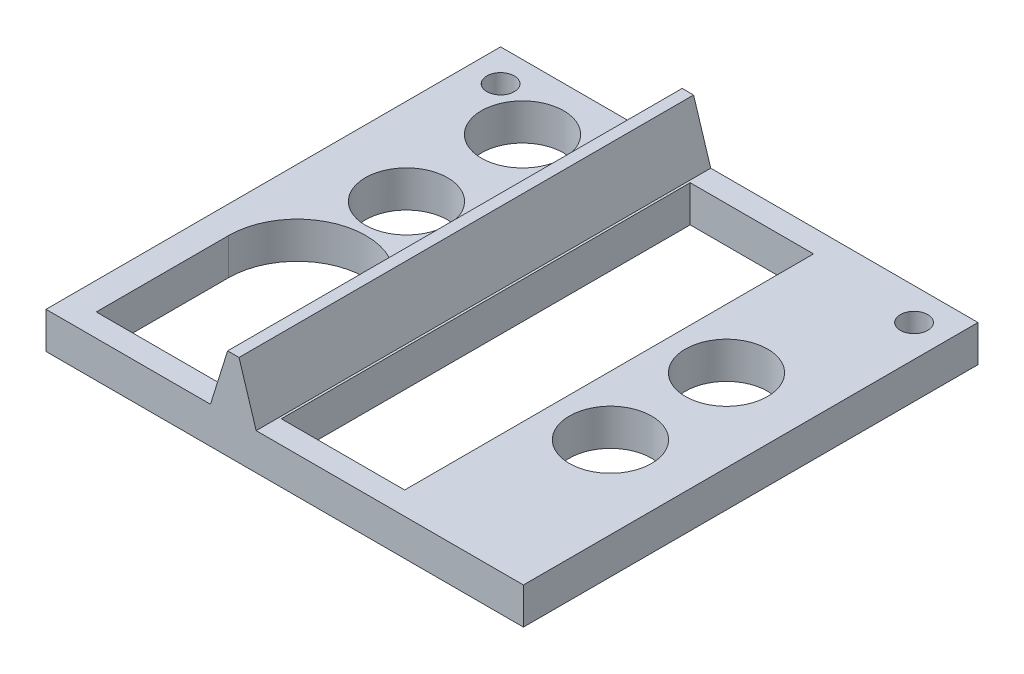
ISO-10303-21;
HEADER;
FILE_DESCRIPTION(('STEP AP214'),'2;1');
FILE_NAME('part.step','',(''),(''),'','','');
FILE_SCHEMA(('AUTOMOTIVE_DESIGN { 1 0 10303 214 1 1 1 1 }'));
ENDSEC;
DATA;
#1=APPLICATION_CONTEXT('core data for automotive mechanical design processes');
#2=APPLICATION_PROTOCOL_DEFINITION('international standard','automotive_design',2000,#1);
#3=PRODUCT_CONTEXT('',#1,'mechanical');
#4=PRODUCT('Part','Part','',(#3));
#5=PRODUCT_RELATED_PRODUCT_CATEGORY('part','',(#4));
#6=PRODUCT_DEFINITION_FORMATION('','',#4);
#7=PRODUCT_DEFINITION_CONTEXT('part definition',#1,'design');
#8=PRODUCT_DEFINITION('design','',#6,#7);
#9=PRODUCT_DEFINITION_SHAPE('','',#8);
#10=(LENGTH_UNIT() NAMED_UNIT(*) SI_UNIT(.MILLI.,.METRE.));
#11=(NAMED_UNIT(*) PLANE_ANGLE_UNIT() SI_UNIT($,.RADIAN.));
#12=(NAMED_UNIT(*) SI_UNIT($,.STERADIAN.) SOLID_ANGLE_UNIT());
#13=UNCERTAINTY_MEASURE_WITH_UNIT(LENGTH_MEASURE(1.E-05),#10,'distance_accuracy_value','');
#14=(GEOMETRIC_REPRESENTATION_CONTEXT(3) GLOBAL_UNCERTAINTY_ASSIGNED_CONTEXT((#13)) GLOBAL_UNIT_ASSIGNED_CONTEXT((#10,
#11,#12)) REPRESENTATION_CONTEXT('',''));
#15=CARTESIAN_POINT('',(0.,0.,0.));
#16=DIRECTION('',(0.,0.,1.));
#17=DIRECTION('',(1.,0.,0.));
#18=AXIS2_PLACEMENT_3D('',#15,#16,#17);
#19=CARTESIAN_POINT('',(-31.25,8.001,15.76));
#20=DIRECTION('',(0.,-1.,0.));
#21=DIRECTION('',(0.,0.,-1.));
#22=AXIS2_PLACEMENT_3D('',#19,#20,#21);
#23=CYLINDRICAL_SURFACE('',#22,15.);
#24=DIRECTION('',(0.,-1.,0.));
#25=VECTOR('',#24,1.);
#26=CARTESIAN_POINT('',(-46.25,8.001,15.76));
#27=LINE('',#26,#25);
#28=CARTESIAN_POINT('',(-46.25,0.,15.76));
#29=VERTEX_POINT('',#28);
#30=CARTESIAN_POINT('',(-46.25,8.,15.76));
#31=VERTEX_POINT('',#30);
#32=EDGE_CURVE('E176',#29,#31,#27,.F.);
#33=ORIENTED_EDGE('',*,*,#32,.F.);
#34=CARTESIAN_POINT('',(-31.25,0.,15.76));
#35=DIRECTION('',(0.,-1.,0.));
#36=DIRECTION('',(0.,0.,-1.));
#37=AXIS2_PLACEMENT_3D('',#34,#35,#36);
#38=CIRCLE('',#37,15.);
#39=CARTESIAN_POINT('',(-16.25,0.,15.76));
#40=VERTEX_POINT('',#39);
#41=EDGE_CURVE('E174',#29,#40,#38,.T.);
#42=ORIENTED_EDGE('',*,*,#41,.T.);
#43=DIRECTION('',(0.,-1.,0.));
#44=VECTOR('',#43,1.);
#45=CARTESIAN_POINT('',(-16.25,8.001,15.76));
#46=LINE('',#45,#44);
#47=CARTESIAN_POINT('',(-16.25,8.,15.76));
#48=VERTEX_POINT('',#47);
#49=EDGE_CURVE('E157',#48,#40,#46,.T.);
#50=ORIENTED_EDGE('',*,*,#49,.F.);
#51=CARTESIAN_POINT('',(-31.25,8.,15.76));
#52=DIRECTION('',(0.,1.,0.));
#53=DIRECTION('',(0.,0.,1.));
#54=AXIS2_PLACEMENT_3D('',#51,#52,#53);
#55=CIRCLE('',#54,15.);
#56=EDGE_CURVE('E172',#31,#48,#55,.F.);
#57=ORIENTED_EDGE('',*,*,#56,.F.);
#58=EDGE_LOOP('',(#33,#42,#50,#57));
#59=FACE_BOUND('',#58,.T.);
#60=ADVANCED_FACE('F39',(#59),#23,.F.);
#61=CARTESIAN_POINT('',(0.,8.,0.));
#62=DIRECTION('',(0.,1.,0.));
#63=DIRECTION('',(0.,0.,1.));
#64=AXIS2_PLACEMENT_3D('',#61,#62,#63);
#65=PLANE('',#64);
#66=CARTESIAN_POINT('',(-45.25,8.,-42.75));
#67=DIRECTION('',(0.,1.,0.));
#68=DIRECTION('',(0.,0.,1.));
#69=AXIS2_PLACEMENT_3D('',#66,#67,#68);
#70=CIRCLE('',#69,3.);
#71=CARTESIAN_POINT('',(-45.25,8.,-39.75));
#72=VERTEX_POINT('',#71);
#73=EDGE_CURVE('E396',#72,#72,#70,.T.);
#74=ORIENTED_EDGE('',*,*,#73,.F.);
#75=EDGE_LOOP('',(#74));
#76=FACE_BOUND('',#75,.T.);
#77=DIRECTION('',(0.,0.,1.));
#78=VECTOR('',#77,1.);
#79=CARTESIAN_POINT('',(-46.25,8.,15.76));
#80=LINE('',#79,#78);
#81=CARTESIAN_POINT('',(-46.25,8.,44.75));
#82=VERTEX_POINT('',#81);
#83=EDGE_CURVE('E185',#31,#82,#80,.T.);
#84=ORIENTED_EDGE('',*,*,#83,.F.);
#85=ORIENTED_EDGE('',*,*,#56,.T.);
#86=DIRECTION('',(0.,0.,-1.));
#87=VECTOR('',#86,1.);
#88=CARTESIAN_POINT('',(-16.25,8.,65.3704993518133));
#89=LINE('',#88,#87);
#90=CARTESIAN_POINT('',(-16.25,8.,-49.75));
#91=VERTEX_POINT('',#90);
#92=EDGE_CURVE('E11',#48,#91,#89,.T.);
#93=ORIENTED_EDGE('',*,*,#92,.T.);
#94=DIRECTION('',(-1.,0.,0.));
#95=VECTOR('',#94,1.);
#96=CARTESIAN_POINT('',(-52.25,8.,-49.75));
#97=LINE('',#96,#95);
#98=CARTESIAN_POINT('',(-52.25,8.,-49.75));
#99=VERTEX_POINT('',#98);
#100=EDGE_CURVE('E278',#91,#99,#97,.T.);
#101=ORIENTED_EDGE('',*,*,#100,.T.);
#102=DIRECTION('',(0.,0.,1.));
#103=VECTOR('',#102,1.);
#104=CARTESIAN_POINT('',(-52.25,8.,-49.75));
#105=LINE('',#104,#103);
#106=CARTESIAN_POINT('',(-52.25,8.,49.75));
#107=VERTEX_POINT('',#106);
#108=EDGE_CURVE('E266',#99,#107,#105,.T.);
#109=ORIENTED_EDGE('',*,*,#108,.T.);
#110=DIRECTION('',(1.,0.,0.));
#111=VECTOR('',#110,1.);
#112=CARTESIAN_POINT('',(-52.25,8.,49.75));
#113=LINE('',#112,#111);
#114=CARTESIAN_POINT('',(-16.25,8.,49.75));
#115=VERTEX_POINT('',#114);
#116=EDGE_CURVE('E272',#107,#115,#113,.T.);
#117=ORIENTED_EDGE('',*,*,#116,.T.);
#118=CARTESIAN_POINT('',(-16.25,8.,44.75));
#119=VERTEX_POINT('',#118);
#120=EDGE_CURVE('E50',#115,#119,#89,.T.);
#121=ORIENTED_EDGE('',*,*,#120,.T.);
#122=DIRECTION('',(1.,0.,0.));
#123=VECTOR('',#122,1.);
#124=CARTESIAN_POINT('',(-46.25,8.,44.75));
#125=LINE('',#124,#123);
#126=EDGE_CURVE('E57',#82,#119,#125,.T.);
#127=ORIENTED_EDGE('',*,*,#126,.F.);
#128=EDGE_LOOP('',(#84,#85,#93,#101,#109,#117,#121,#127));
#129=FACE_BOUND('',#128,.T.);
#130=CARTESIAN_POINT('',(-33.25,8.,-10.15));
#131=DIRECTION('',(0.,1.,0.));
#132=DIRECTION('',(0.,0.,1.));
#133=AXIS2_PLACEMENT_3D('',#130,#131,#132);
#134=CIRCLE('',#133,9.00000000000001);
#135=CARTESIAN_POINT('',(-33.25,8.,-1.15000000000001));
#136=VERTEX_POINT('',#135);
#137=EDGE_CURVE('E246',#136,#136,#134,.F.);
#138=ORIENTED_EDGE('',*,*,#137,.T.);
#139=EDGE_LOOP('',(#138));
#140=FACE_BOUND('',#139,.T.);
#141=CARTESIAN_POINT('',(-33.25,8.,-35.55));
#142=DIRECTION('',(0.,1.,0.));
#143=DIRECTION('',(0.,0.,1.));
#144=AXIS2_PLACEMENT_3D('',#141,#142,#143);
#145=CIRCLE('',#144,9.00000000000001);
#146=CARTESIAN_POINT('',(-33.25,8.,-26.55));
#147=VERTEX_POINT('',#146);
#148=EDGE_CURVE('E247',#147,#147,#145,.F.);
#149=ORIENTED_EDGE('',*,*,#148,.T.);
#150=EDGE_LOOP('',(#149));
#151=FACE_BOUND('',#150,.T.);
#152=ADVANCED_FACE('F181',(#76,#129,#140,#151),#65,.T.);
#153=CARTESIAN_POINT('',(-52.25,8.,-49.75));
#154=DIRECTION('',(1.,0.,0.));
#155=DIRECTION('',(0.,0.,-1.));
#156=AXIS2_PLACEMENT_3D('',#153,#154,#155);
#157=PLANE('',#156);
#158=DIRECTION('',(0.,0.,1.));
#159=VECTOR('',#158,1.);
#160=CARTESIAN_POINT('',(-52.25,0.,-49.75));
#161=LINE('',#160,#159);
#162=CARTESIAN_POINT('',(-52.25,0.,-49.75));
#163=VERTEX_POINT('',#162);
#164=CARTESIAN_POINT('',(-52.25,0.,49.75));
#165=VERTEX_POINT('',#164);
#166=EDGE_CURVE('E262',#163,#165,#161,.T.);
#167=ORIENTED_EDGE('',*,*,#166,.T.);
#168=DIRECTION('',(0.,-1.,0.));
#169=VECTOR('',#168,1.);
#170=CARTESIAN_POINT('',(-52.25,8.,49.75));
#171=LINE('',#170,#169);
#172=EDGE_CURVE('E43',#107,#165,#171,.T.);
#173=ORIENTED_EDGE('',*,*,#172,.F.);
#174=ORIENTED_EDGE('',*,*,#108,.F.);
#175=DIRECTION('',(0.,-1.,0.));
#176=VECTOR('',#175,1.);
#177=CARTESIAN_POINT('',(-52.25,8.,-49.75));
#178=LINE('',#177,#176);
#179=EDGE_CURVE('E282',#99,#163,#178,.T.);
#180=ORIENTED_EDGE('',*,*,#179,.T.);
#181=EDGE_LOOP('',(#167,#173,#174,#180));
#182=FACE_BOUND('',#181,.T.);
#183=ADVANCED_FACE('F41',(#182),#157,.F.);
#184=CARTESIAN_POINT('',(-52.25,8.,49.75));
#185=DIRECTION('',(0.,0.,-1.));
#186=DIRECTION('',(-1.,0.,0.));
#187=AXIS2_PLACEMENT_3D('',#184,#185,#186);
#188=PLANE('',#187);
#189=DIRECTION('',(1.,0.,0.));
#190=VECTOR('',#189,1.);
#191=CARTESIAN_POINT('',(-52.25,0.,49.75));
#192=LINE('',#191,#190);
#193=CARTESIAN_POINT('',(52.25,0.,49.75));
#194=VERTEX_POINT('',#193);
#195=EDGE_CURVE('E286',#165,#194,#192,.T.);
#196=ORIENTED_EDGE('',*,*,#195,.T.);
#197=DIRECTION('',(0.,-1.,0.));
#198=VECTOR('',#197,1.);
#199=CARTESIAN_POINT('',(52.25,8.,49.75));
#200=LINE('',#199,#198);
#201=CARTESIAN_POINT('',(52.25,8.,49.75));
#202=VERTEX_POINT('',#201);
#203=EDGE_CURVE('E300',#202,#194,#200,.T.);
#204=ORIENTED_EDGE('',*,*,#203,.F.);
#205=CARTESIAN_POINT('',(-6.25000000000001,8.,49.75));
#206=VERTEX_POINT('',#205);
#207=EDGE_CURVE('E270',#206,#202,#113,.T.);
#208=ORIENTED_EDGE('',*,*,#207,.F.);
#209=DIRECTION('',(-0.298274993135947,0.95447997803503,0.));
#210=VECTOR('',#209,1.);
#211=CARTESIAN_POINT('',(-6.24999999999998,8.,49.75));
#212=LINE('',#211,#210);
#213=CARTESIAN_POINT('',(-9.99999999999998,20.,49.75));
#214=VERTEX_POINT('',#213);
#215=EDGE_CURVE('E211',#206,#214,#212,.T.);
#216=ORIENTED_EDGE('',*,*,#215,.T.);
#217=DIRECTION('',(-1.,0.,0.));
#218=VECTOR('',#217,1.);
#219=CARTESIAN_POINT('',(-9.99999999999998,20.,49.75));
#220=LINE('',#219,#218);
#221=CARTESIAN_POINT('',(-12.5,20.,49.75));
#222=VERTEX_POINT('',#221);
#223=EDGE_CURVE('E221',#214,#222,#220,.T.);
#224=ORIENTED_EDGE('',*,*,#223,.T.);
#225=DIRECTION('',(-0.298274993135947,-0.95447997803503,0.));
#226=VECTOR('',#225,1.);
#227=CARTESIAN_POINT('',(-12.5,20.,49.75));
#228=LINE('',#227,#226);
#229=EDGE_CURVE('E187',#222,#115,#228,.T.);
#230=ORIENTED_EDGE('',*,*,#229,.T.);
#231=ORIENTED_EDGE('',*,*,#116,.F.);
#232=ORIENTED_EDGE('',*,*,#172,.T.);
#233=EDGE_LOOP('',(#196,#204,#208,#216,#224,#230,#231,#232));
#234=FACE_BOUND('',#233,.T.);
#235=ADVANCED_FACE('F311',(#234),#188,.F.);
#236=CARTESIAN_POINT('',(52.25,8.,-49.75));
#237=DIRECTION('',(-1.,0.,0.));
#238=DIRECTION('',(0.,0.,1.));
#239=AXIS2_PLACEMENT_3D('',#236,#237,#238);
#240=PLANE('',#239);
#241=DIRECTION('',(0.,0.,-1.));
#242=VECTOR('',#241,1.);
#243=CARTESIAN_POINT('',(52.25,0.,-49.75));
#244=LINE('',#243,#242);
#245=CARTESIAN_POINT('',(52.25,0.,-49.75));
#246=VERTEX_POINT('',#245);
#247=EDGE_CURVE('E289',#194,#246,#244,.T.);
#248=ORIENTED_EDGE('',*,*,#247,.T.);
#249=DIRECTION('',(0.,-1.,0.));
#250=VECTOR('',#249,1.);
#251=CARTESIAN_POINT('',(52.25,8.,-49.75));
#252=LINE('',#251,#250);
#253=CARTESIAN_POINT('',(52.25,8.,-49.75));
#254=VERTEX_POINT('',#253);
#255=EDGE_CURVE('E297',#254,#246,#252,.T.);
#256=ORIENTED_EDGE('',*,*,#255,.F.);
#257=DIRECTION('',(0.,0.,-1.));
#258=VECTOR('',#257,1.);
#259=CARTESIAN_POINT('',(52.25,8.,-49.75));
#260=LINE('',#259,#258);
#261=EDGE_CURVE('E275',#202,#254,#260,.T.);
#262=ORIENTED_EDGE('',*,*,#261,.F.);
#263=ORIENTED_EDGE('',*,*,#203,.T.);
#264=EDGE_LOOP('',(#248,#256,#262,#263));
#265=FACE_BOUND('',#264,.T.);
#266=ADVANCED_FACE('F320',(#265),#240,.F.);
#267=CARTESIAN_POINT('',(-52.25,8.,-49.75));
#268=DIRECTION('',(0.,0.,1.));
#269=DIRECTION('',(1.,0.,0.));
#270=AXIS2_PLACEMENT_3D('',#267,#268,#269);
#271=PLANE('',#270);
#272=DIRECTION('',(-1.,0.,0.));
#273=VECTOR('',#272,1.);
#274=CARTESIAN_POINT('',(-52.25,0.,-49.75));
#275=LINE('',#274,#273);
#276=EDGE_CURVE('E271',#246,#163,#275,.T.);
#277=ORIENTED_EDGE('',*,*,#276,.T.);
#278=ORIENTED_EDGE('',*,*,#179,.F.);
#279=ORIENTED_EDGE('',*,*,#100,.F.);
#280=DIRECTION('',(0.298274993135947,0.95447997803503,0.));
#281=VECTOR('',#280,1.);
#282=CARTESIAN_POINT('',(-12.5,20.,-49.75));
#283=LINE('',#282,#281);
#284=CARTESIAN_POINT('',(-12.5,20.,-49.75));
#285=VERTEX_POINT('',#284);
#286=EDGE_CURVE('E193',#91,#285,#283,.T.);
#287=ORIENTED_EDGE('',*,*,#286,.T.);
#288=DIRECTION('',(1.,0.,0.));
#289=VECTOR('',#288,1.);
#290=CARTESIAN_POINT('',(-9.99999999999999,20.,-49.75));
#291=LINE('',#290,#289);
#292=CARTESIAN_POINT('',(-9.99999999999999,20.,-49.75));
#293=VERTEX_POINT('',#292);
#294=EDGE_CURVE('E200',#285,#293,#291,.T.);
#295=ORIENTED_EDGE('',*,*,#294,.T.);
#296=DIRECTION('',(0.298274993135947,-0.95447997803503,0.));
#297=VECTOR('',#296,1.);
#298=CARTESIAN_POINT('',(-6.25,8.,-49.75));
#299=LINE('',#298,#297);
#300=CARTESIAN_POINT('',(-6.25,8.,-49.75));
#301=VERTEX_POINT('',#300);
#302=EDGE_CURVE('E205',#293,#301,#299,.T.);
#303=ORIENTED_EDGE('',*,*,#302,.T.);
#304=EDGE_CURVE('E279',#254,#301,#97,.T.);
#305=ORIENTED_EDGE('',*,*,#304,.F.);
#306=ORIENTED_EDGE('',*,*,#255,.T.);
#307=EDGE_LOOP('',(#277,#278,#279,#287,#295,#303,#305,#306));
#308=FACE_BOUND('',#307,.T.);
#309=ADVANCED_FACE('F322',(#308),#271,.F.);
#310=CARTESIAN_POINT('',(45.25,8.,-42.75));
#311=DIRECTION('',(0.,1.,0.));
#312=DIRECTION('',(0.,0.,1.));
#313=AXIS2_PLACEMENT_3D('',#310,#311,#312);
#314=CIRCLE('',#313,3.);
#315=CARTESIAN_POINT('',(45.25,8.,-39.75));
#316=VERTEX_POINT('',#315);
#317=EDGE_CURVE('E397',#316,#316,#314,.T.);
#318=ORIENTED_EDGE('',*,*,#317,.F.);
#319=EDGE_LOOP('',(#318));
#320=FACE_BOUND('',#319,.T.);
#321=DIRECTION('',(0.,0.,1.));
#322=VECTOR('',#321,1.);
#323=CARTESIAN_POINT('',(-5.75000000000001,8.,-44.75));
#324=LINE('',#323,#322);
#325=CARTESIAN_POINT('',(-5.75000000000001,8.,-44.75));
#326=VERTEX_POINT('',#325);
#327=CARTESIAN_POINT('',(-5.74999999999999,8.,44.75));
#328=VERTEX_POINT('',#327);
#329=EDGE_CURVE('E65',#326,#328,#324,.T.);
#330=ORIENTED_EDGE('',*,*,#329,.F.);
#331=DIRECTION('',(-1.,0.,0.));
#332=VECTOR('',#331,1.);
#333=CARTESIAN_POINT('',(-5.75000000000001,8.,-44.75));
#334=LINE('',#333,#332);
#335=CARTESIAN_POINT('',(21.25,8.,-44.75));
#336=VERTEX_POINT('',#335);
#337=EDGE_CURVE('E340',#336,#326,#334,.T.);
#338=ORIENTED_EDGE('',*,*,#337,.F.);
#339=DIRECTION('',(0.,0.,-1.));
#340=VECTOR('',#339,1.);
#341=CARTESIAN_POINT('',(21.25,8.,-44.75));
#342=LINE('',#341,#340);
#343=CARTESIAN_POINT('',(21.25,8.,44.75));
#344=VERTEX_POINT('',#343);
#345=EDGE_CURVE('E351',#344,#336,#342,.T.);
#346=ORIENTED_EDGE('',*,*,#345,.F.);
#347=DIRECTION('',(1.,0.,0.));
#348=VECTOR('',#347,1.);
#349=CARTESIAN_POINT('',(-5.74999999999999,8.,44.75));
#350=LINE('',#349,#348);
#351=EDGE_CURVE('E355',#328,#344,#350,.T.);
#352=ORIENTED_EDGE('',*,*,#351,.F.);
#353=EDGE_LOOP('',(#330,#338,#346,#352));
#354=FACE_BOUND('',#353,.T.);
#355=DIRECTION('',(0.,0.,-1.));
#356=VECTOR('',#355,1.);
#357=CARTESIAN_POINT('',(-6.24999999999998,8.,65.3704993518133));
#358=LINE('',#357,#356);
#359=EDGE_CURVE('E217',#206,#301,#358,.T.);
#360=ORIENTED_EDGE('',*,*,#359,.F.);
#361=ORIENTED_EDGE('',*,*,#207,.T.);
#362=ORIENTED_EDGE('',*,*,#261,.T.);
#363=ORIENTED_EDGE('',*,*,#304,.T.);
#364=EDGE_LOOP('',(#360,#361,#362,#363));
#365=FACE_BOUND('',#364,.T.);
#366=CARTESIAN_POINT('',(34.25,8.,12.7));
#367=DIRECTION('',(0.,1.,0.));
#368=DIRECTION('',(0.,0.,1.));
#369=AXIS2_PLACEMENT_3D('',#366,#367,#368);
#370=CIRCLE('',#369,9.);
#371=CARTESIAN_POINT('',(34.25,8.,21.7));
#372=VERTEX_POINT('',#371);
#373=EDGE_CURVE('E235',#372,#372,#370,.F.);
#374=ORIENTED_EDGE('',*,*,#373,.T.);
#375=EDGE_LOOP('',(#374));
#376=FACE_BOUND('',#375,.T.);
#377=CARTESIAN_POINT('',(34.25,8.,-12.7));
#378=DIRECTION('',(0.,1.,0.));
#379=DIRECTION('',(0.,0.,1.));
#380=AXIS2_PLACEMENT_3D('',#377,#378,#379);
#381=CIRCLE('',#380,9.);
#382=CARTESIAN_POINT('',(34.25,8.,-3.7));
#383=VERTEX_POINT('',#382);
#384=EDGE_CURVE('E236',#383,#383,#381,.F.);
#385=ORIENTED_EDGE('',*,*,#384,.T.);
#386=EDGE_LOOP('',(#385));
#387=FACE_BOUND('',#386,.T.);
#388=ADVANCED_FACE('F325',(#320,#354,#365,#376,#387),#65,.T.);
#389=CARTESIAN_POINT('',(0.,0.,0.));
#390=DIRECTION('',(0.,1.,0.));
#391=DIRECTION('',(0.,0.,1.));
#392=AXIS2_PLACEMENT_3D('',#389,#390,#391);
#393=PLANE('',#392);
#394=CARTESIAN_POINT('',(-45.25,0.,-42.75));
#395=DIRECTION('',(0.,1.,0.));
#396=DIRECTION('',(0.,0.,1.));
#397=AXIS2_PLACEMENT_3D('',#394,#395,#396);
#398=CIRCLE('',#397,3.);
#399=CARTESIAN_POINT('',(-45.25,0.,-39.75));
#400=VERTEX_POINT('',#399);
#401=EDGE_CURVE('E177',#400,#400,#398,.F.);
#402=ORIENTED_EDGE('',*,*,#401,.F.);
#403=EDGE_LOOP('',(#402));
#404=FACE_BOUND('',#403,.T.);
#405=CARTESIAN_POINT('',(45.25,0.,-42.75));
#406=DIRECTION('',(0.,1.,0.));
#407=DIRECTION('',(0.,0.,1.));
#408=AXIS2_PLACEMENT_3D('',#405,#406,#407);
#409=CIRCLE('',#408,3.);
#410=CARTESIAN_POINT('',(45.25,0.,-39.75));
#411=VERTEX_POINT('',#410);
#412=EDGE_CURVE('E392',#411,#411,#409,.F.);
#413=ORIENTED_EDGE('',*,*,#412,.F.);
#414=EDGE_LOOP('',(#413));
#415=FACE_BOUND('',#414,.T.);
#416=ORIENTED_EDGE('',*,*,#41,.F.);
#417=DIRECTION('',(0.,0.,-1.));
#418=VECTOR('',#417,1.);
#419=CARTESIAN_POINT('',(-46.25,0.,15.76));
#420=LINE('',#419,#418);
#421=CARTESIAN_POINT('',(-46.25,0.,44.75));
#422=VERTEX_POINT('',#421);
#423=EDGE_CURVE('E384',#422,#29,#420,.T.);
#424=ORIENTED_EDGE('',*,*,#423,.F.);
#425=DIRECTION('',(-1.,0.,0.));
#426=VECTOR('',#425,1.);
#427=CARTESIAN_POINT('',(-46.25,0.,44.75));
#428=LINE('',#427,#426);
#429=CARTESIAN_POINT('',(-16.25,0.,44.75));
#430=VERTEX_POINT('',#429);
#431=EDGE_CURVE('E372',#430,#422,#428,.T.);
#432=ORIENTED_EDGE('',*,*,#431,.F.);
#433=DIRECTION('',(0.,0.,1.));
#434=VECTOR('',#433,1.);
#435=CARTESIAN_POINT('',(-16.25,0.,15.76));
#436=LINE('',#435,#434);
#437=EDGE_CURVE('E387',#40,#430,#436,.T.);
#438=ORIENTED_EDGE('',*,*,#437,.F.);
#439=EDGE_LOOP('',(#416,#424,#432,#438));
#440=FACE_BOUND('',#439,.T.);
#441=DIRECTION('',(1.,0.,0.));
#442=VECTOR('',#441,1.);
#443=CARTESIAN_POINT('',(-5.75000000000001,0.,-44.75));
#444=LINE('',#443,#442);
#445=CARTESIAN_POINT('',(-5.75000000000001,0.,-44.75));
#446=VERTEX_POINT('',#445);
#447=CARTESIAN_POINT('',(21.25,0.,-44.75));
#448=VERTEX_POINT('',#447);
#449=EDGE_CURVE('E365',#446,#448,#444,.T.);
#450=ORIENTED_EDGE('',*,*,#449,.F.);
#451=DIRECTION('',(0.,0.,-1.));
#452=VECTOR('',#451,1.);
#453=CARTESIAN_POINT('',(-5.75000000000001,0.,-44.75));
#454=LINE('',#453,#452);
#455=CARTESIAN_POINT('',(-5.74999999999999,0.,44.75));
#456=VERTEX_POINT('',#455);
#457=EDGE_CURVE('E361',#456,#446,#454,.T.);
#458=ORIENTED_EDGE('',*,*,#457,.F.);
#459=DIRECTION('',(-1.,0.,0.));
#460=VECTOR('',#459,1.);
#461=CARTESIAN_POINT('',(-5.74999999999999,0.,44.75));
#462=LINE('',#461,#460);
#463=CARTESIAN_POINT('',(21.25,0.,44.75));
#464=VERTEX_POINT('',#463);
#465=EDGE_CURVE('E201',#464,#456,#462,.T.);
#466=ORIENTED_EDGE('',*,*,#465,.F.);
#467=DIRECTION('',(0.,0.,1.));
#468=VECTOR('',#467,1.);
#469=CARTESIAN_POINT('',(21.25,0.,-44.75));
#470=LINE('',#469,#468);
#471=EDGE_CURVE('E369',#448,#464,#470,.T.);
#472=ORIENTED_EDGE('',*,*,#471,.F.);
#473=EDGE_LOOP('',(#450,#458,#466,#472));
#474=FACE_BOUND('',#473,.T.);
#475=CARTESIAN_POINT('',(-33.25,0.,-35.55));
#476=DIRECTION('',(0.,-1.,0.));
#477=DIRECTION('',(0.,0.,-1.));
#478=AXIS2_PLACEMENT_3D('',#475,#476,#477);
#479=CIRCLE('',#478,9.00000000000001);
#480=CARTESIAN_POINT('',(-33.25,0.,-44.55));
#481=VERTEX_POINT('',#480);
#482=EDGE_CURVE('E242',#481,#481,#479,.T.);
#483=ORIENTED_EDGE('',*,*,#482,.F.);
#484=EDGE_LOOP('',(#483));
#485=FACE_BOUND('',#484,.T.);
#486=CARTESIAN_POINT('',(34.25,0.,12.7));
#487=DIRECTION('',(0.,-1.,0.));
#488=DIRECTION('',(0.,0.,-1.));
#489=AXIS2_PLACEMENT_3D('',#486,#487,#488);
#490=CIRCLE('',#489,9.);
#491=CARTESIAN_POINT('',(34.25,0.,3.7));
#492=VERTEX_POINT('',#491);
#493=EDGE_CURVE('E251',#492,#492,#490,.T.);
#494=ORIENTED_EDGE('',*,*,#493,.F.);
#495=EDGE_LOOP('',(#494));
#496=FACE_BOUND('',#495,.T.);
#497=CARTESIAN_POINT('',(34.25,0.,-12.7));
#498=DIRECTION('',(0.,-1.,0.));
#499=DIRECTION('',(0.,0.,-1.));
#500=AXIS2_PLACEMENT_3D('',#497,#498,#499);
#501=CIRCLE('',#500,9.);
#502=CARTESIAN_POINT('',(34.25,0.,-21.7));
#503=VERTEX_POINT('',#502);
#504=EDGE_CURVE('E231',#503,#503,#501,.T.);
#505=ORIENTED_EDGE('',*,*,#504,.F.);
#506=EDGE_LOOP('',(#505));
#507=FACE_BOUND('',#506,.T.);
#508=CARTESIAN_POINT('',(-33.25,0.,-10.15));
#509=DIRECTION('',(0.,-1.,0.));
#510=DIRECTION('',(0.,0.,-1.));
#511=AXIS2_PLACEMENT_3D('',#508,#509,#510);
#512=CIRCLE('',#511,9.00000000000001);
#513=CARTESIAN_POINT('',(-33.25,0.,-19.15));
#514=VERTEX_POINT('',#513);
#515=EDGE_CURVE('E258',#514,#514,#512,.T.);
#516=ORIENTED_EDGE('',*,*,#515,.F.);
#517=EDGE_LOOP('',(#516));
#518=FACE_BOUND('',#517,.T.);
#519=ORIENTED_EDGE('',*,*,#166,.F.);
#520=ORIENTED_EDGE('',*,*,#276,.F.);
#521=ORIENTED_EDGE('',*,*,#247,.F.);
#522=ORIENTED_EDGE('',*,*,#195,.F.);
#523=EDGE_LOOP('',(#519,#520,#521,#522));
#524=FACE_BOUND('',#523,.T.);
#525=ADVANCED_FACE('F318',(#404,#415,#440,#474,#485,#496,#507,#518,#524),#393,.F.);
#526=CARTESIAN_POINT('',(-33.25,8.001,-10.15));
#527=DIRECTION('',(0.,-1.,0.));
#528=DIRECTION('',(0.,0.,-1.));
#529=AXIS2_PLACEMENT_3D('',#526,#527,#528);
#530=CYLINDRICAL_SURFACE('',#529,9.00000000000001);
#531=ORIENTED_EDGE('',*,*,#137,.F.);
#532=EDGE_LOOP('',(#531));
#533=FACE_BOUND('',#532,.T.);
#534=ORIENTED_EDGE('',*,*,#515,.T.);
#535=EDGE_LOOP('',(#534));
#536=FACE_BOUND('',#535,.T.);
#537=ADVANCED_FACE('F426',(#533,#536),#530,.F.);
#538=CARTESIAN_POINT('',(34.25,8.001,-12.7));
#539=DIRECTION('',(0.,-1.,0.));
#540=DIRECTION('',(0.,0.,-1.));
#541=AXIS2_PLACEMENT_3D('',#538,#539,#540);
#542=CYLINDRICAL_SURFACE('',#541,9.);
#543=ORIENTED_EDGE('',*,*,#384,.F.);
#544=EDGE_LOOP('',(#543));
#545=FACE_BOUND('',#544,.T.);
#546=ORIENTED_EDGE('',*,*,#504,.T.);
#547=EDGE_LOOP('',(#546));
#548=FACE_BOUND('',#547,.T.);
#549=ADVANCED_FACE('F470',(#545,#548),#542,.F.);
#550=CARTESIAN_POINT('',(34.25,8.001,12.7));
#551=DIRECTION('',(0.,-1.,0.));
#552=DIRECTION('',(0.,0.,-1.));
#553=AXIS2_PLACEMENT_3D('',#550,#551,#552);
#554=CYLINDRICAL_SURFACE('',#553,9.);
#555=ORIENTED_EDGE('',*,*,#373,.F.);
#556=EDGE_LOOP('',(#555));
#557=FACE_BOUND('',#556,.T.);
#558=ORIENTED_EDGE('',*,*,#493,.T.);
#559=EDGE_LOOP('',(#558));
#560=FACE_BOUND('',#559,.T.);
#561=ADVANCED_FACE('F472',(#557,#560),#554,.F.);
#562=CARTESIAN_POINT('',(-33.25,8.001,-35.55));
#563=DIRECTION('',(0.,-1.,0.));
#564=DIRECTION('',(0.,0.,-1.));
#565=AXIS2_PLACEMENT_3D('',#562,#563,#564);
#566=CYLINDRICAL_SURFACE('',#565,9.00000000000001);
#567=ORIENTED_EDGE('',*,*,#148,.F.);
#568=EDGE_LOOP('',(#567));
#569=FACE_BOUND('',#568,.T.);
#570=ORIENTED_EDGE('',*,*,#482,.T.);
#571=EDGE_LOOP('',(#570));
#572=FACE_BOUND('',#571,.T.);
#573=ADVANCED_FACE('F464',(#569,#572),#566,.F.);
#574=CARTESIAN_POINT('',(-6.24999999999998,8.,65.3704993518133));
#575=DIRECTION('',(0.95447997803503,0.298274993135947,0.));
#576=DIRECTION('',(-0.298274993135947,0.95447997803503,0.));
#577=AXIS2_PLACEMENT_3D('',#574,#575,#576);
#578=PLANE('',#577);
#579=ORIENTED_EDGE('',*,*,#215,.F.);
#580=ORIENTED_EDGE('',*,*,#359,.T.);
#581=ORIENTED_EDGE('',*,*,#302,.F.);
#582=DIRECTION('',(0.,0.,-1.));
#583=VECTOR('',#582,1.);
#584=CARTESIAN_POINT('',(-9.99999999999998,20.,65.3704993518133));
#585=LINE('',#584,#583);
#586=EDGE_CURVE('E222',#214,#293,#585,.T.);
#587=ORIENTED_EDGE('',*,*,#586,.F.);
#588=EDGE_LOOP('',(#579,#580,#581,#587));
#589=FACE_BOUND('',#588,.T.);
#590=ADVANCED_FACE('F330',(#589),#578,.T.);
#591=CARTESIAN_POINT('',(-9.99999999999998,20.,65.3704993518133));
#592=DIRECTION('',(0.,1.,0.));
#593=DIRECTION('',(0.,0.,1.));
#594=AXIS2_PLACEMENT_3D('',#591,#592,#593);
#595=PLANE('',#594);
#596=ORIENTED_EDGE('',*,*,#223,.F.);
#597=ORIENTED_EDGE('',*,*,#586,.T.);
#598=ORIENTED_EDGE('',*,*,#294,.F.);
#599=DIRECTION('',(0.,0.,-1.));
#600=VECTOR('',#599,1.);
#601=CARTESIAN_POINT('',(-12.5,20.,65.3704993518133));
#602=LINE('',#601,#600);
#603=EDGE_CURVE('E195',#222,#285,#602,.T.);
#604=ORIENTED_EDGE('',*,*,#603,.F.);
#605=EDGE_LOOP('',(#596,#597,#598,#604));
#606=FACE_BOUND('',#605,.T.);
#607=ADVANCED_FACE('F463',(#606),#595,.T.);
#608=CARTESIAN_POINT('',(-12.5,20.,65.3704993518133));
#609=DIRECTION('',(-0.95447997803503,0.298274993135947,0.));
#610=DIRECTION('',(-0.298274993135947,-0.95447997803503,0.));
#611=AXIS2_PLACEMENT_3D('',#608,#609,#610);
#612=PLANE('',#611);
#613=ORIENTED_EDGE('',*,*,#229,.F.);
#614=ORIENTED_EDGE('',*,*,#603,.T.);
#615=ORIENTED_EDGE('',*,*,#286,.F.);
#616=ORIENTED_EDGE('',*,*,#92,.F.);
#617=DIRECTION('',(0.,0.,-1.));
#618=VECTOR('',#617,1.);
#619=CARTESIAN_POINT('',(-16.25,8.,15.76));
#620=LINE('',#619,#618);
#621=EDGE_CURVE('E153',#119,#48,#620,.T.);
#622=ORIENTED_EDGE('',*,*,#621,.F.);
#623=ORIENTED_EDGE('',*,*,#120,.F.);
#624=EDGE_LOOP('',(#613,#614,#615,#616,#622,#623));
#625=FACE_BOUND('',#624,.T.);
#626=ADVANCED_FACE('F191',(#625),#612,.T.);
#627=CARTESIAN_POINT('',(-5.75000000000001,-0.000999999999999265,-44.75));
#628=DIRECTION('',(-1.,0.,0.));
#629=DIRECTION('',(0.,0.,1.));
#630=AXIS2_PLACEMENT_3D('',#627,#628,#629);
#631=PLANE('',#630);
#632=ORIENTED_EDGE('',*,*,#457,.T.);
#633=DIRECTION('',(0.,1.,0.));
#634=VECTOR('',#633,1.);
#635=CARTESIAN_POINT('',(-5.75000000000001,-0.000999999999999265,-44.75));
#636=LINE('',#635,#634);
#637=EDGE_CURVE('E208',#446,#326,#636,.T.);
#638=ORIENTED_EDGE('',*,*,#637,.T.);
#639=ORIENTED_EDGE('',*,*,#329,.T.);
#640=DIRECTION('',(0.,1.,0.));
#641=VECTOR('',#640,1.);
#642=CARTESIAN_POINT('',(-5.74999999999999,-0.000999999999999265,44.75));
#643=LINE('',#642,#641);
#644=EDGE_CURVE('E336',#456,#328,#643,.T.);
#645=ORIENTED_EDGE('',*,*,#644,.F.);
#646=EDGE_LOOP('',(#632,#638,#639,#645));
#647=FACE_BOUND('',#646,.T.);
#648=ADVANCED_FACE('F439',(#647),#631,.F.);
#649=CARTESIAN_POINT('',(-5.75000000000001,-0.000999999999999265,-44.75));
#650=DIRECTION('',(0.,0.,-1.));
#651=DIRECTION('',(-1.,0.,0.));
#652=AXIS2_PLACEMENT_3D('',#649,#650,#651);
#653=PLANE('',#652);
#654=ORIENTED_EDGE('',*,*,#449,.T.);
#655=DIRECTION('',(0.,1.,0.));
#656=VECTOR('',#655,1.);
#657=CARTESIAN_POINT('',(21.25,-0.000999999999999265,-44.75));
#658=LINE('',#657,#656);
#659=EDGE_CURVE('E343',#448,#336,#658,.T.);
#660=ORIENTED_EDGE('',*,*,#659,.T.);
#661=ORIENTED_EDGE('',*,*,#337,.T.);
#662=ORIENTED_EDGE('',*,*,#637,.F.);
#663=EDGE_LOOP('',(#654,#660,#661,#662));
#664=FACE_BOUND('',#663,.T.);
#665=ADVANCED_FACE('F445',(#664),#653,.F.);
#666=CARTESIAN_POINT('',(21.25,-0.000999999999999265,-44.75));
#667=DIRECTION('',(1.,0.,0.));
#668=DIRECTION('',(0.,0.,-1.));
#669=AXIS2_PLACEMENT_3D('',#666,#667,#668);
#670=PLANE('',#669);
#671=ORIENTED_EDGE('',*,*,#471,.T.);
#672=DIRECTION('',(0.,1.,0.));
#673=VECTOR('',#672,1.);
#674=CARTESIAN_POINT('',(21.25,-0.000999999999999265,44.75));
#675=LINE('',#674,#673);
#676=EDGE_CURVE('E339',#464,#344,#675,.T.);
#677=ORIENTED_EDGE('',*,*,#676,.T.);
#678=ORIENTED_EDGE('',*,*,#345,.T.);
#679=ORIENTED_EDGE('',*,*,#659,.F.);
#680=EDGE_LOOP('',(#671,#677,#678,#679));
#681=FACE_BOUND('',#680,.T.);
#682=ADVANCED_FACE('F447',(#681),#670,.F.);
#683=CARTESIAN_POINT('',(-5.74999999999999,-0.000999999999999265,44.75));
#684=DIRECTION('',(0.,0.,1.));
#685=DIRECTION('',(1.,0.,0.));
#686=AXIS2_PLACEMENT_3D('',#683,#684,#685);
#687=PLANE('',#686);
#688=ORIENTED_EDGE('',*,*,#465,.T.);
#689=ORIENTED_EDGE('',*,*,#644,.T.);
#690=ORIENTED_EDGE('',*,*,#351,.T.);
#691=ORIENTED_EDGE('',*,*,#676,.F.);
#692=EDGE_LOOP('',(#688,#689,#690,#691));
#693=FACE_BOUND('',#692,.T.);
#694=ADVANCED_FACE('F436',(#693),#687,.F.);
#695=CARTESIAN_POINT('',(-46.25,-0.000999999999999265,15.76));
#696=DIRECTION('',(-1.,0.,0.));
#697=DIRECTION('',(0.,0.,1.));
#698=AXIS2_PLACEMENT_3D('',#695,#696,#697);
#699=PLANE('',#698);
#700=ORIENTED_EDGE('',*,*,#423,.T.);
#701=ORIENTED_EDGE('',*,*,#32,.T.);
#702=ORIENTED_EDGE('',*,*,#83,.T.);
#703=DIRECTION('',(0.,1.,0.));
#704=VECTOR('',#703,1.);
#705=CARTESIAN_POINT('',(-46.25,-0.000999999999999265,44.75));
#706=LINE('',#705,#704);
#707=EDGE_CURVE('E165',#422,#82,#706,.T.);
#708=ORIENTED_EDGE('',*,*,#707,.F.);
#709=EDGE_LOOP('',(#700,#701,#702,#708));
#710=FACE_BOUND('',#709,.T.);
#711=ADVANCED_FACE('F454',(#710),#699,.F.);
#712=CARTESIAN_POINT('',(-16.25,-0.000999999999999265,15.76));
#713=DIRECTION('',(1.,0.,0.));
#714=DIRECTION('',(0.,0.,-1.));
#715=AXIS2_PLACEMENT_3D('',#712,#713,#714);
#716=PLANE('',#715);
#717=ORIENTED_EDGE('',*,*,#437,.T.);
#718=DIRECTION('',(0.,1.,0.));
#719=VECTOR('',#718,1.);
#720=CARTESIAN_POINT('',(-16.25,-0.000999999999999265,44.75));
#721=LINE('',#720,#719);
#722=EDGE_CURVE('E159',#430,#119,#721,.T.);
#723=ORIENTED_EDGE('',*,*,#722,.T.);
#724=ORIENTED_EDGE('',*,*,#621,.T.);
#725=ORIENTED_EDGE('',*,*,#49,.T.);
#726=EDGE_LOOP('',(#717,#723,#724,#725));
#727=FACE_BOUND('',#726,.T.);
#728=ADVANCED_FACE('F156',(#727),#716,.F.);
#729=CARTESIAN_POINT('',(-46.25,-0.000999999999999265,44.75));
#730=DIRECTION('',(0.,0.,1.));
#731=DIRECTION('',(1.,0.,0.));
#732=AXIS2_PLACEMENT_3D('',#729,#730,#731);
#733=PLANE('',#732);
#734=ORIENTED_EDGE('',*,*,#431,.T.);
#735=ORIENTED_EDGE('',*,*,#707,.T.);
#736=ORIENTED_EDGE('',*,*,#126,.T.);
#737=ORIENTED_EDGE('',*,*,#722,.F.);
#738=EDGE_LOOP('',(#734,#735,#736,#737));
#739=FACE_BOUND('',#738,.T.);
#740=ADVANCED_FACE('F568',(#739),#733,.F.);
#741=CARTESIAN_POINT('',(45.25,-0.000999999999999265,-42.75));
#742=DIRECTION('',(0.,1.,0.));
#743=DIRECTION('',(0.,0.,1.));
#744=AXIS2_PLACEMENT_3D('',#741,#742,#743);
#745=CYLINDRICAL_SURFACE('',#744,3.);
#746=ORIENTED_EDGE('',*,*,#317,.T.);
#747=EDGE_LOOP('',(#746));
#748=FACE_BOUND('',#747,.T.);
#749=ORIENTED_EDGE('',*,*,#412,.T.);
#750=EDGE_LOOP('',(#749));
#751=FACE_BOUND('',#750,.T.);
#752=ADVANCED_FACE('F576',(#748,#751),#745,.F.);
#753=CARTESIAN_POINT('',(-45.25,-0.000999999999999265,-42.75));
#754=DIRECTION('',(0.,1.,0.));
#755=DIRECTION('',(0.,0.,1.));
#756=AXIS2_PLACEMENT_3D('',#753,#754,#755);
#757=CYLINDRICAL_SURFACE('',#756,3.);
#758=ORIENTED_EDGE('',*,*,#73,.T.);
#759=EDGE_LOOP('',(#758));
#760=FACE_BOUND('',#759,.T.);
#761=ORIENTED_EDGE('',*,*,#401,.T.);
#762=EDGE_LOOP('',(#761));
#763=FACE_BOUND('',#762,.T.);
#764=ADVANCED_FACE('F408',(#760,#763),#757,.F.);
#765=CLOSED_SHELL('',(#60,#152,#183,#235,#266,#309,#388,#525,#537,#549,#561,#573,#590,#607,#626,
#648,#665,#682,#694,#711,#728,#740,#752,#764));
#766=MANIFOLD_SOLID_BREP('B2',#765);
#767=ADVANCED_BREP_SHAPE_REPRESENTATION('',(#18,#766),#14);
#768=SHAPE_DEFINITION_REPRESENTATION(#9,#767);
ENDSEC;
END-ISO-10303-21;
